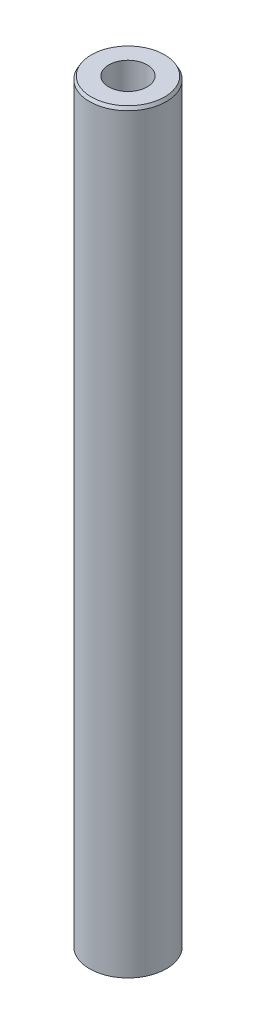
ISO-10303-21;
HEADER;
FILE_DESCRIPTION(('STEP AP214'),'2;1');
FILE_NAME('part.step','',(''),(''),'','','');
FILE_SCHEMA(('AUTOMOTIVE_DESIGN { 1 0 10303 214 1 1 1 1 }'));
ENDSEC;
DATA;
#1=APPLICATION_CONTEXT('core data for automotive mechanical design processes');
#2=APPLICATION_PROTOCOL_DEFINITION('international standard','automotive_design',2000,#1);
#3=PRODUCT_CONTEXT('',#1,'mechanical');
#4=PRODUCT('Part','Part','',(#3));
#5=PRODUCT_RELATED_PRODUCT_CATEGORY('part','',(#4));
#6=PRODUCT_DEFINITION_FORMATION('','',#4);
#7=PRODUCT_DEFINITION_CONTEXT('part definition',#1,'design');
#8=PRODUCT_DEFINITION('design','',#6,#7);
#9=PRODUCT_DEFINITION_SHAPE('','',#8);
#10=(LENGTH_UNIT() NAMED_UNIT(*) SI_UNIT(.MILLI.,.METRE.));
#11=(NAMED_UNIT(*) PLANE_ANGLE_UNIT() SI_UNIT($,.RADIAN.));
#12=(NAMED_UNIT(*) SI_UNIT($,.STERADIAN.) SOLID_ANGLE_UNIT());
#13=UNCERTAINTY_MEASURE_WITH_UNIT(LENGTH_MEASURE(1.E-05),#10,'distance_accuracy_value','');
#14=(GEOMETRIC_REPRESENTATION_CONTEXT(3) GLOBAL_UNCERTAINTY_ASSIGNED_CONTEXT((#13)) GLOBAL_UNIT_ASSIGNED_CONTEXT((#10,
#11,#12)) REPRESENTATION_CONTEXT('',''));
#15=CARTESIAN_POINT('',(0.,0.,0.));
#16=DIRECTION('',(0.,0.,1.));
#17=DIRECTION('',(1.,0.,0.));
#18=AXIS2_PLACEMENT_3D('',#15,#16,#17);
#19=CARTESIAN_POINT('',(0.,147.724730706187,0.));
#20=DIRECTION('',(0.,-1.,0.));
#21=DIRECTION('',(0.,0.,-1.));
#22=AXIS2_PLACEMENT_3D('',#19,#20,#21);
#23=CYLINDRICAL_SURFACE('',#22,7.5);
#24=CARTESIAN_POINT('',(0.,147.118890288477,0.));
#25=DIRECTION('',(0.,1.,0.));
#26=DIRECTION('',(0.,0.,1.));
#27=AXIS2_PLACEMENT_3D('',#24,#25,#26);
#28=CIRCLE('',#27,7.5);
#29=CARTESIAN_POINT('',(0.,147.118890288477,7.5));
#30=VERTEX_POINT('',#29);
#31=EDGE_CURVE('E50',#30,#30,#28,.F.);
#32=ORIENTED_EDGE('',*,*,#31,.T.);
#33=EDGE_LOOP('',(#32));
#34=FACE_BOUND('',#33,.T.);
#35=CARTESIAN_POINT('',(0.,0.349782128251236,0.));
#36=DIRECTION('',(0.,1.,0.));
#37=DIRECTION('',(0.,0.,1.));
#38=AXIS2_PLACEMENT_3D('',#35,#36,#37);
#39=CIRCLE('',#38,7.5);
#40=CARTESIAN_POINT('',(0.,0.349782128251236,7.5));
#41=VERTEX_POINT('',#40);
#42=EDGE_CURVE('E51',#41,#41,#39,.T.);
#43=ORIENTED_EDGE('',*,*,#42,.T.);
#44=EDGE_LOOP('',(#43));
#45=FACE_BOUND('',#44,.T.);
#46=ADVANCED_FACE('F39',(#34,#45),#23,.T.);
#47=CARTESIAN_POINT('',(0.,147.724730706187,0.));
#48=DIRECTION('',(0.,1.,0.));
#49=DIRECTION('',(0.,0.,1.));
#50=AXIS2_PLACEMENT_3D('',#47,#48,#49);
#51=PLANE('',#50);
#52=CARTESIAN_POINT('',(0.,147.724730706187,0.));
#53=DIRECTION('',(0.,1.,0.));
#54=DIRECTION('',(0.,0.,1.));
#55=AXIS2_PLACEMENT_3D('',#52,#53,#54);
#56=CIRCLE('',#55,7.15021787174877);
#57=CARTESIAN_POINT('',(0.,147.724730706187,7.15021787174877));
#58=VERTEX_POINT('',#57);
#59=EDGE_CURVE('E54',#58,#58,#56,.T.);
#60=ORIENTED_EDGE('',*,*,#59,.T.);
#61=EDGE_LOOP('',(#60));
#62=FACE_BOUND('',#61,.T.);
#63=CARTESIAN_POINT('',(0.,147.724730706187,0.));
#64=DIRECTION('',(0.,1.,0.));
#65=DIRECTION('',(0.,0.,1.));
#66=AXIS2_PLACEMENT_3D('',#63,#64,#65);
#67=CIRCLE('',#66,3.74771361184648);
#68=CARTESIAN_POINT('',(0.,147.724730706187,3.74771361184648));
#69=VERTEX_POINT('',#68);
#70=EDGE_CURVE('E58',#69,#69,#67,.T.);
#71=ORIENTED_EDGE('',*,*,#70,.F.);
#72=EDGE_LOOP('',(#71));
#73=FACE_BOUND('',#72,.T.);
#74=ADVANCED_FACE('F69',(#62,#73),#51,.T.);
#75=CARTESIAN_POINT('',(0.,0.,0.));
#76=DIRECTION('',(0.,1.,0.));
#77=DIRECTION('',(0.,0.,1.));
#78=AXIS2_PLACEMENT_3D('',#75,#76,#77);
#79=PLANE('',#78);
#80=CARTESIAN_POINT('',(0.,0.,0.));
#81=DIRECTION('',(0.,1.,0.));
#82=DIRECTION('',(0.,0.,1.));
#83=AXIS2_PLACEMENT_3D('',#80,#81,#82);
#84=CIRCLE('',#83,6.89415958228928);
#85=CARTESIAN_POINT('',(0.,0.,6.89415958228928));
#86=VERTEX_POINT('',#85);
#87=EDGE_CURVE('E10',#86,#86,#84,.F.);
#88=ORIENTED_EDGE('',*,*,#87,.T.);
#89=EDGE_LOOP('',(#88));
#90=FACE_BOUND('',#89,.T.);
#91=CARTESIAN_POINT('',(0.,0.,0.));
#92=DIRECTION('',(0.,1.,0.));
#93=DIRECTION('',(0.,0.,1.));
#94=AXIS2_PLACEMENT_3D('',#91,#92,#93);
#95=CIRCLE('',#94,3.74771361184648);
#96=CARTESIAN_POINT('',(0.,0.,3.74771361184648));
#97=VERTEX_POINT('',#96);
#98=EDGE_CURVE('E63',#97,#97,#95,.T.);
#99=ORIENTED_EDGE('',*,*,#98,.T.);
#100=EDGE_LOOP('',(#99));
#101=FACE_BOUND('',#100,.T.);
#102=ADVANCED_FACE('F75',(#90,#101),#79,.F.);
#103=CARTESIAN_POINT('',(0.,147.724730706187,0.));
#104=DIRECTION('',(0.,-1.,0.));
#105=DIRECTION('',(0.,0.,-1.));
#106=AXIS2_PLACEMENT_3D('',#103,#104,#105);
#107=CYLINDRICAL_SURFACE('',#106,3.74771361184648);
#108=ORIENTED_EDGE('',*,*,#70,.T.);
#109=EDGE_LOOP('',(#108));
#110=FACE_BOUND('',#109,.T.);
#111=ORIENTED_EDGE('',*,*,#98,.F.);
#112=EDGE_LOOP('',(#111));
#113=FACE_BOUND('',#112,.T.);
#114=ADVANCED_FACE('F70',(#110,#113),#107,.F.);
#115=CARTESIAN_POINT('',(0.,147.724730706187,0.));
#116=DIRECTION('',(0.,-1.,0.));
#117=DIRECTION('',(0.,0.,-1.));
#118=AXIS2_PLACEMENT_3D('',#115,#116,#117);
#119=CONICAL_SURFACE('',#118,7.15021787174877,0.523598775598283);
#120=ORIENTED_EDGE('',*,*,#31,.F.);
#121=EDGE_LOOP('',(#120));
#122=FACE_BOUND('',#121,.T.);
#123=ORIENTED_EDGE('',*,*,#59,.F.);
#124=EDGE_LOOP('',(#123));
#125=FACE_BOUND('',#124,.T.);
#126=ADVANCED_FACE('F81',(#122,#125),#119,.T.);
#127=CARTESIAN_POINT('',(0.,0.349782128251236,0.));
#128=DIRECTION('',(0.,1.,0.));
#129=DIRECTION('',(0.,0.,1.));
#130=AXIS2_PLACEMENT_3D('',#127,#128,#129);
#131=CONICAL_SURFACE('',#130,7.5,1.0471975511966);
#132=ORIENTED_EDGE('',*,*,#87,.F.);
#133=EDGE_LOOP('',(#132));
#134=FACE_BOUND('',#133,.T.);
#135=ORIENTED_EDGE('',*,*,#42,.F.);
#136=EDGE_LOOP('',(#135));
#137=FACE_BOUND('',#136,.T.);
#138=ADVANCED_FACE('F45',(#134,#137),#131,.T.);
#139=CLOSED_SHELL('',(#46,#74,#102,#114,#126,#138));
#140=MANIFOLD_SOLID_BREP('B2',#139);
#141=ADVANCED_BREP_SHAPE_REPRESENTATION('',(#18,#140),#14);
#142=SHAPE_DEFINITION_REPRESENTATION(#9,#141);
ENDSEC;
END-ISO-10303-21;
